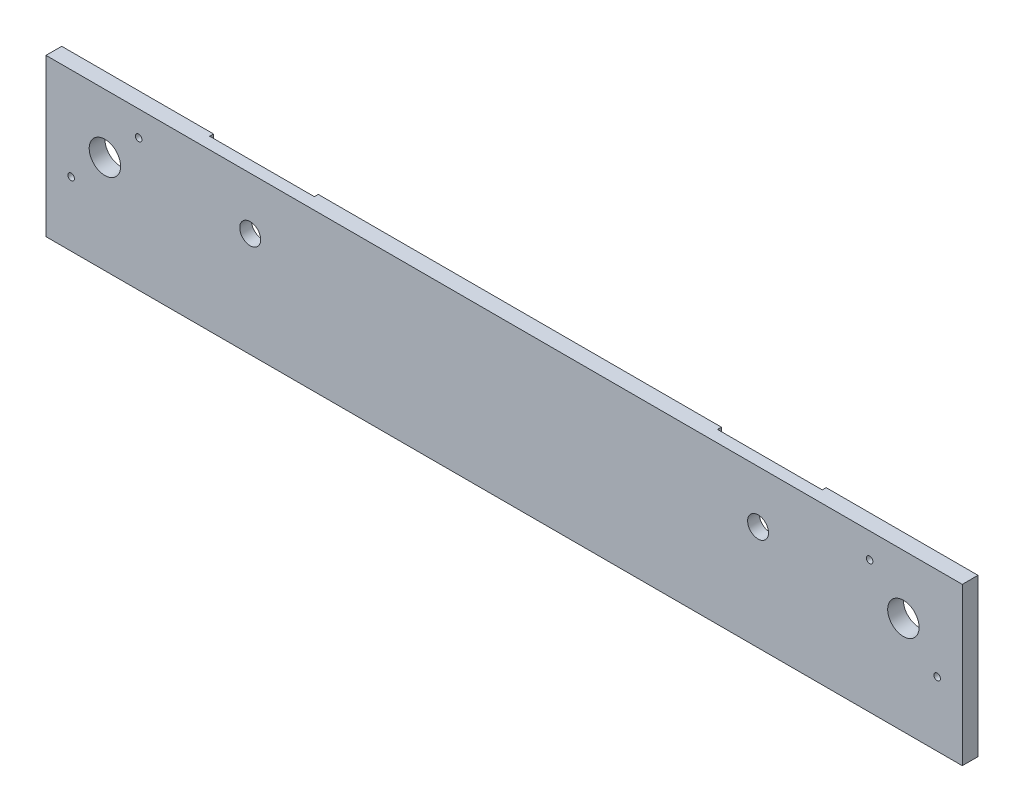
ISO-10303-21;
HEADER;
FILE_DESCRIPTION(('STEP AP214'),'2;1');
FILE_NAME('part.step','',(''),(''),'','','');
FILE_SCHEMA(('AUTOMOTIVE_DESIGN { 1 0 10303 214 1 1 1 1 }'));
ENDSEC;
DATA;
#1=APPLICATION_CONTEXT('core data for automotive mechanical design processes');
#2=APPLICATION_PROTOCOL_DEFINITION('international standard','automotive_design',2000,#1);
#3=PRODUCT_CONTEXT('',#1,'mechanical');
#4=PRODUCT('Part','Part','',(#3));
#5=PRODUCT_RELATED_PRODUCT_CATEGORY('part','',(#4));
#6=PRODUCT_DEFINITION_FORMATION('','',#4);
#7=PRODUCT_DEFINITION_CONTEXT('part definition',#1,'design');
#8=PRODUCT_DEFINITION('design','',#6,#7);
#9=PRODUCT_DEFINITION_SHAPE('','',#8);
#10=(LENGTH_UNIT() NAMED_UNIT(*) SI_UNIT(.MILLI.,.METRE.));
#11=(NAMED_UNIT(*) PLANE_ANGLE_UNIT() SI_UNIT($,.RADIAN.));
#12=(NAMED_UNIT(*) SI_UNIT($,.STERADIAN.) SOLID_ANGLE_UNIT());
#13=UNCERTAINTY_MEASURE_WITH_UNIT(LENGTH_MEASURE(1.E-05),#10,'distance_accuracy_value','');
#14=(GEOMETRIC_REPRESENTATION_CONTEXT(3) GLOBAL_UNCERTAINTY_ASSIGNED_CONTEXT((#13)) GLOBAL_UNIT_ASSIGNED_CONTEXT((#10,
#11,#12)) REPRESENTATION_CONTEXT('',''));
#15=CARTESIAN_POINT('',(0.,0.,0.));
#16=DIRECTION('',(0.,0.,1.));
#17=DIRECTION('',(1.,0.,0.));
#18=AXIS2_PLACEMENT_3D('',#15,#16,#17);
#19=CARTESIAN_POINT('',(-350.,0.,6.));
#20=DIRECTION('',(0.,1.,0.));
#21=DIRECTION('',(0.,0.,1.));
#22=AXIS2_PLACEMENT_3D('',#19,#20,#21);
#23=PLANE('',#22);
#24=DIRECTION('',(1.,0.,0.));
#25=VECTOR('',#24,1.);
#26=CARTESIAN_POINT('',(-350.,0.,0.));
#27=LINE('',#26,#25);
#28=CARTESIAN_POINT('',(-58.,0.,0.));
#29=VERTEX_POINT('',#28);
#30=CARTESIAN_POINT('',(0.,0.,0.));
#31=VERTEX_POINT('',#30);
#32=EDGE_CURVE('E294',#29,#31,#27,.T.);
#33=ORIENTED_EDGE('',*,*,#32,.F.);
#34=DIRECTION('',(0.,0.,-1.));
#35=VECTOR('',#34,1.);
#36=CARTESIAN_POINT('',(-58.,0.,1.5));
#37=LINE('',#36,#35);
#38=CARTESIAN_POINT('',(-58.,0.,1.5));
#39=VERTEX_POINT('',#38);
#40=EDGE_CURVE('E196',#39,#29,#37,.T.);
#41=ORIENTED_EDGE('',*,*,#40,.F.);
#42=DIRECTION('',(-1.,0.,0.));
#43=VECTOR('',#42,1.);
#44=CARTESIAN_POINT('',(0.,0.,1.5));
#45=LINE('',#44,#43);
#46=CARTESIAN_POINT('',(-98.,0.,1.5));
#47=VERTEX_POINT('',#46);
#48=EDGE_CURVE('E180',#39,#47,#45,.T.);
#49=ORIENTED_EDGE('',*,*,#48,.T.);
#50=DIRECTION('',(0.,0.,-1.));
#51=VECTOR('',#50,1.);
#52=CARTESIAN_POINT('',(-98.,0.,1.5));
#53=LINE('',#52,#51);
#54=CARTESIAN_POINT('',(-98.,0.,0.));
#55=VERTEX_POINT('',#54);
#56=EDGE_CURVE('E198',#47,#55,#53,.T.);
#57=ORIENTED_EDGE('',*,*,#56,.T.);
#58=CARTESIAN_POINT('',(-252.,0.,0.));
#59=VERTEX_POINT('',#58);
#60=EDGE_CURVE('E299',#59,#55,#27,.T.);
#61=ORIENTED_EDGE('',*,*,#60,.F.);
#62=DIRECTION('',(0.,0.,-1.));
#63=VECTOR('',#62,1.);
#64=CARTESIAN_POINT('',(-252.,0.,1.5));
#65=LINE('',#64,#63);
#66=CARTESIAN_POINT('',(-252.,0.,1.5));
#67=VERTEX_POINT('',#66);
#68=EDGE_CURVE('E234',#67,#59,#65,.T.);
#69=ORIENTED_EDGE('',*,*,#68,.F.);
#70=DIRECTION('',(-1.,0.,0.));
#71=VECTOR('',#70,1.);
#72=CARTESIAN_POINT('',(0.,0.,1.5));
#73=LINE('',#72,#71);
#74=CARTESIAN_POINT('',(-292.,0.,1.5));
#75=VERTEX_POINT('',#74);
#76=EDGE_CURVE('E215',#67,#75,#73,.T.);
#77=ORIENTED_EDGE('',*,*,#76,.T.);
#78=DIRECTION('',(0.,0.,-1.));
#79=VECTOR('',#78,1.);
#80=CARTESIAN_POINT('',(-292.,0.,1.5));
#81=LINE('',#80,#79);
#82=CARTESIAN_POINT('',(-292.,0.,0.));
#83=VERTEX_POINT('',#82);
#84=EDGE_CURVE('E236',#75,#83,#81,.T.);
#85=ORIENTED_EDGE('',*,*,#84,.T.);
#86=CARTESIAN_POINT('',(-350.,0.,0.));
#87=VERTEX_POINT('',#86);
#88=EDGE_CURVE('E295',#87,#83,#27,.T.);
#89=ORIENTED_EDGE('',*,*,#88,.F.);
#90=DIRECTION('',(0.,0.,-1.));
#91=VECTOR('',#90,1.);
#92=CARTESIAN_POINT('',(-350.,0.,6.));
#93=LINE('',#92,#91);
#94=CARTESIAN_POINT('',(-350.,0.,6.));
#95=VERTEX_POINT('',#94);
#96=EDGE_CURVE('E291',#95,#87,#93,.T.);
#97=ORIENTED_EDGE('',*,*,#96,.F.);
#98=DIRECTION('',(1.,0.,0.));
#99=VECTOR('',#98,1.);
#100=CARTESIAN_POINT('',(-350.,0.,6.));
#101=LINE('',#100,#99);
#102=CARTESIAN_POINT('',(0.,0.,6.));
#103=VERTEX_POINT('',#102);
#104=EDGE_CURVE('E283',#95,#103,#101,.T.);
#105=ORIENTED_EDGE('',*,*,#104,.T.);
#106=DIRECTION('',(0.,0.,-1.));
#107=VECTOR('',#106,1.);
#108=CARTESIAN_POINT('',(0.,0.,6.));
#109=LINE('',#108,#107);
#110=EDGE_CURVE('E305',#103,#31,#109,.T.);
#111=ORIENTED_EDGE('',*,*,#110,.T.);
#112=EDGE_LOOP('',(#33,#41,#49,#57,#61,#69,#77,#85,#89,#97,#105,#111));
#113=FACE_BOUND('',#112,.T.);
#114=ADVANCED_FACE('F33',(#113),#23,.T.);
#115=CARTESIAN_POINT('',(0.,0.,0.));
#116=DIRECTION('',(0.,0.,-1.));
#117=DIRECTION('',(-1.,0.,0.));
#118=AXIS2_PLACEMENT_3D('',#115,#116,#117);
#119=PLANE('',#118);
#120=CARTESIAN_POINT('',(-9.59530124334555,-35.4046987566545,0.));
#121=DIRECTION('',(0.,0.,1.));
#122=DIRECTION('',(1.,0.,0.));
#123=AXIS2_PLACEMENT_3D('',#120,#121,#122);
#124=CIRCLE('',#123,1.25);
#125=CARTESIAN_POINT('',(-8.34530124334555,-35.4046987566545,0.));
#126=VERTEX_POINT('',#125);
#127=EDGE_CURVE('E269',#126,#126,#124,.T.);
#128=ORIENTED_EDGE('',*,*,#127,.T.);
#129=EDGE_LOOP('',(#128));
#130=FACE_BOUND('',#129,.T.);
#131=CARTESIAN_POINT('',(-35.4046987566545,-9.59530124334549,0.));
#132=DIRECTION('',(0.,0.,1.));
#133=DIRECTION('',(1.,0.,0.));
#134=AXIS2_PLACEMENT_3D('',#131,#132,#133);
#135=CIRCLE('',#134,1.25000000000001);
#136=CARTESIAN_POINT('',(-34.1546987566545,-9.59530124334549,0.));
#137=VERTEX_POINT('',#136);
#138=EDGE_CURVE('E263',#137,#137,#135,.T.);
#139=ORIENTED_EDGE('',*,*,#138,.T.);
#140=EDGE_LOOP('',(#139));
#141=FACE_BOUND('',#140,.T.);
#142=CARTESIAN_POINT('',(-314.595301243345,-9.59530124334546,0.));
#143=DIRECTION('',(0.,0.,1.));
#144=DIRECTION('',(1.,0.,0.));
#145=AXIS2_PLACEMENT_3D('',#142,#143,#144);
#146=CIRCLE('',#145,1.24999999999996);
#147=CARTESIAN_POINT('',(-313.345301243346,-9.59530124334546,0.));
#148=VERTEX_POINT('',#147);
#149=EDGE_CURVE('E257',#148,#148,#146,.T.);
#150=ORIENTED_EDGE('',*,*,#149,.T.);
#151=EDGE_LOOP('',(#150));
#152=FACE_BOUND('',#151,.T.);
#153=CARTESIAN_POINT('',(-340.404698756654,-35.4046987566545,0.));
#154=DIRECTION('',(0.,0.,1.));
#155=DIRECTION('',(1.,0.,0.));
#156=AXIS2_PLACEMENT_3D('',#153,#154,#155);
#157=CIRCLE('',#156,1.24999999999996);
#158=CARTESIAN_POINT('',(-339.154698756654,-35.4046987566545,0.));
#159=VERTEX_POINT('',#158);
#160=EDGE_CURVE('E251',#159,#159,#157,.T.);
#161=ORIENTED_EDGE('',*,*,#160,.T.);
#162=EDGE_LOOP('',(#161));
#163=FACE_BOUND('',#162,.T.);
#164=CARTESIAN_POINT('',(-22.5,-22.5,0.));
#165=DIRECTION('',(0.,0.,1.));
#166=DIRECTION('',(1.,0.,0.));
#167=AXIS2_PLACEMENT_3D('',#164,#165,#166);
#168=CIRCLE('',#167,6.);
#169=CARTESIAN_POINT('',(-16.5,-22.5,0.));
#170=VERTEX_POINT('',#169);
#171=EDGE_CURVE('E244',#170,#170,#168,.T.);
#172=ORIENTED_EDGE('',*,*,#171,.T.);
#173=EDGE_LOOP('',(#172));
#174=FACE_BOUND('',#173,.T.);
#175=CARTESIAN_POINT('',(-327.5,-22.5,0.));
#176=DIRECTION('',(0.,0.,1.));
#177=DIRECTION('',(1.,0.,0.));
#178=AXIS2_PLACEMENT_3D('',#175,#176,#177);
#179=CIRCLE('',#178,5.99999999999999);
#180=CARTESIAN_POINT('',(-321.5,-22.5,0.));
#181=VERTEX_POINT('',#180);
#182=EDGE_CURVE('E274',#181,#181,#179,.T.);
#183=ORIENTED_EDGE('',*,*,#182,.T.);
#184=EDGE_LOOP('',(#183));
#185=FACE_BOUND('',#184,.T.);
#186=CARTESIAN_POINT('',(-62.,-36.,0.));
#187=DIRECTION('',(0.,0.,-1.));
#188=DIRECTION('',(-1.,0.,0.));
#189=AXIS2_PLACEMENT_3D('',#186,#187,#188);
#190=CIRCLE('',#189,4.);
#191=CARTESIAN_POINT('',(-58.,-36.,0.));
#192=VERTEX_POINT('',#191);
#193=CARTESIAN_POINT('',(-62.,-40.,0.));
#194=VERTEX_POINT('',#193);
#195=EDGE_CURVE('E50',#192,#194,#190,.T.);
#196=ORIENTED_EDGE('',*,*,#195,.F.);
#197=DIRECTION('',(0.,1.,0.));
#198=VECTOR('',#197,1.);
#199=CARTESIAN_POINT('',(-58.,0.,0.));
#200=LINE('',#199,#198);
#201=EDGE_CURVE('E168',#192,#29,#200,.T.);
#202=ORIENTED_EDGE('',*,*,#201,.T.);
#203=ORIENTED_EDGE('',*,*,#32,.T.);
#204=DIRECTION('',(0.,1.,0.));
#205=VECTOR('',#204,1.);
#206=CARTESIAN_POINT('',(0.,-60.,0.));
#207=LINE('',#206,#205);
#208=CARTESIAN_POINT('',(0.,-60.,0.));
#209=VERTEX_POINT('',#208);
#210=EDGE_CURVE('E298',#209,#31,#207,.T.);
#211=ORIENTED_EDGE('',*,*,#210,.F.);
#212=DIRECTION('',(1.,0.,0.));
#213=VECTOR('',#212,1.);
#214=CARTESIAN_POINT('',(-350.,-60.,0.));
#215=LINE('',#214,#213);
#216=CARTESIAN_POINT('',(-350.,-60.,0.));
#217=VERTEX_POINT('',#216);
#218=EDGE_CURVE('E284',#217,#209,#215,.T.);
#219=ORIENTED_EDGE('',*,*,#218,.F.);
#220=DIRECTION('',(0.,1.,0.));
#221=VECTOR('',#220,1.);
#222=CARTESIAN_POINT('',(-350.,-60.,0.));
#223=LINE('',#222,#221);
#224=EDGE_CURVE('E277',#217,#87,#223,.T.);
#225=ORIENTED_EDGE('',*,*,#224,.T.);
#226=ORIENTED_EDGE('',*,*,#88,.T.);
#227=DIRECTION('',(0.,-1.,0.));
#228=VECTOR('',#227,1.);
#229=CARTESIAN_POINT('',(-292.,0.,0.));
#230=LINE('',#229,#228);
#231=CARTESIAN_POINT('',(-292.,-36.,0.));
#232=VERTEX_POINT('',#231);
#233=EDGE_CURVE('E228',#83,#232,#230,.T.);
#234=ORIENTED_EDGE('',*,*,#233,.T.);
#235=CARTESIAN_POINT('',(-288.,-36.,0.));
#236=DIRECTION('',(0.,0.,-1.));
#237=DIRECTION('',(-1.,0.,0.));
#238=AXIS2_PLACEMENT_3D('',#235,#236,#237);
#239=CIRCLE('',#238,4.);
#240=CARTESIAN_POINT('',(-288.,-40.,0.));
#241=VERTEX_POINT('',#240);
#242=EDGE_CURVE('E225',#241,#232,#239,.T.);
#243=ORIENTED_EDGE('',*,*,#242,.F.);
#244=DIRECTION('',(1.,0.,0.));
#245=VECTOR('',#244,1.);
#246=CARTESIAN_POINT('',(0.,-40.,0.));
#247=LINE('',#246,#245);
#248=CARTESIAN_POINT('',(-256.,-40.,0.));
#249=VERTEX_POINT('',#248);
#250=EDGE_CURVE('E222',#241,#249,#247,.T.);
#251=ORIENTED_EDGE('',*,*,#250,.T.);
#252=CARTESIAN_POINT('',(-256.,-36.,0.));
#253=DIRECTION('',(0.,0.,-1.));
#254=DIRECTION('',(-1.,0.,0.));
#255=AXIS2_PLACEMENT_3D('',#252,#253,#254);
#256=CIRCLE('',#255,4.);
#257=CARTESIAN_POINT('',(-252.,-36.,0.));
#258=VERTEX_POINT('',#257);
#259=EDGE_CURVE('E58',#258,#249,#256,.T.);
#260=ORIENTED_EDGE('',*,*,#259,.F.);
#261=DIRECTION('',(0.,1.,0.));
#262=VECTOR('',#261,1.);
#263=CARTESIAN_POINT('',(-252.,0.,0.));
#264=LINE('',#263,#262);
#265=EDGE_CURVE('E208',#258,#59,#264,.T.);
#266=ORIENTED_EDGE('',*,*,#265,.T.);
#267=ORIENTED_EDGE('',*,*,#60,.T.);
#268=DIRECTION('',(0.,-1.,0.));
#269=VECTOR('',#268,1.);
#270=CARTESIAN_POINT('',(-98.,0.,0.));
#271=LINE('',#270,#269);
#272=CARTESIAN_POINT('',(-98.,-36.,0.));
#273=VERTEX_POINT('',#272);
#274=EDGE_CURVE('E171',#55,#273,#271,.T.);
#275=ORIENTED_EDGE('',*,*,#274,.T.);
#276=CARTESIAN_POINT('',(-94.,-36.,0.));
#277=DIRECTION('',(0.,0.,-1.));
#278=DIRECTION('',(-1.,0.,0.));
#279=AXIS2_PLACEMENT_3D('',#276,#277,#278);
#280=CIRCLE('',#279,4.);
#281=CARTESIAN_POINT('',(-94.,-40.,0.));
#282=VERTEX_POINT('',#281);
#283=EDGE_CURVE('E188',#282,#273,#280,.T.);
#284=ORIENTED_EDGE('',*,*,#283,.F.);
#285=DIRECTION('',(1.,0.,0.));
#286=VECTOR('',#285,1.);
#287=CARTESIAN_POINT('',(0.,-40.,0.));
#288=LINE('',#287,#286);
#289=EDGE_CURVE('E185',#282,#194,#288,.T.);
#290=ORIENTED_EDGE('',*,*,#289,.T.);
#291=EDGE_LOOP('',(#196,#202,#203,#211,#219,#225,#226,#234,#243,#251,#260,#266,#267,#275,#284,#290));
#292=FACE_BOUND('',#291,.T.);
#293=ADVANCED_FACE('F358',(#130,#141,#152,#163,#174,#185,#292),#119,.T.);
#294=CARTESIAN_POINT('',(-350.,-60.,6.));
#295=DIRECTION('',(-1.,0.,0.));
#296=DIRECTION('',(0.,0.,1.));
#297=AXIS2_PLACEMENT_3D('',#294,#295,#296);
#298=PLANE('',#297);
#299=ORIENTED_EDGE('',*,*,#224,.F.);
#300=DIRECTION('',(0.,0.,-1.));
#301=VECTOR('',#300,1.);
#302=CARTESIAN_POINT('',(-350.,-60.,6.));
#303=LINE('',#302,#301);
#304=CARTESIAN_POINT('',(-350.,-60.,6.));
#305=VERTEX_POINT('',#304);
#306=EDGE_CURVE('E11',#305,#217,#303,.T.);
#307=ORIENTED_EDGE('',*,*,#306,.F.);
#308=DIRECTION('',(0.,1.,0.));
#309=VECTOR('',#308,1.);
#310=CARTESIAN_POINT('',(-350.,-60.,6.));
#311=LINE('',#310,#309);
#312=EDGE_CURVE('E280',#305,#95,#311,.T.);
#313=ORIENTED_EDGE('',*,*,#312,.T.);
#314=ORIENTED_EDGE('',*,*,#96,.T.);
#315=EDGE_LOOP('',(#299,#307,#313,#314));
#316=FACE_BOUND('',#315,.T.);
#317=ADVANCED_FACE('F35',(#316),#298,.T.);
#318=CARTESIAN_POINT('',(-350.,-60.,6.));
#319=DIRECTION('',(0.,1.,0.));
#320=DIRECTION('',(0.,0.,1.));
#321=AXIS2_PLACEMENT_3D('',#318,#319,#320);
#322=PLANE('',#321);
#323=ORIENTED_EDGE('',*,*,#218,.T.);
#324=DIRECTION('',(0.,0.,-1.));
#325=VECTOR('',#324,1.);
#326=CARTESIAN_POINT('',(0.,-60.,6.));
#327=LINE('',#326,#325);
#328=CARTESIAN_POINT('',(0.,-60.,6.));
#329=VERTEX_POINT('',#328);
#330=EDGE_CURVE('E42',#329,#209,#327,.T.);
#331=ORIENTED_EDGE('',*,*,#330,.F.);
#332=DIRECTION('',(1.,0.,0.));
#333=VECTOR('',#332,1.);
#334=CARTESIAN_POINT('',(-350.,-60.,6.));
#335=LINE('',#334,#333);
#336=EDGE_CURVE('E289',#305,#329,#335,.T.);
#337=ORIENTED_EDGE('',*,*,#336,.F.);
#338=ORIENTED_EDGE('',*,*,#306,.T.);
#339=EDGE_LOOP('',(#323,#331,#337,#338));
#340=FACE_BOUND('',#339,.T.);
#341=ADVANCED_FACE('F350',(#340),#322,.F.);
#342=CARTESIAN_POINT('',(0.,-60.,6.));
#343=DIRECTION('',(-1.,0.,0.));
#344=DIRECTION('',(0.,0.,1.));
#345=AXIS2_PLACEMENT_3D('',#342,#343,#344);
#346=PLANE('',#345);
#347=ORIENTED_EDGE('',*,*,#210,.T.);
#348=ORIENTED_EDGE('',*,*,#110,.F.);
#349=DIRECTION('',(0.,1.,0.));
#350=VECTOR('',#349,1.);
#351=CARTESIAN_POINT('',(0.,-60.,6.));
#352=LINE('',#351,#350);
#353=EDGE_CURVE('E287',#329,#103,#352,.T.);
#354=ORIENTED_EDGE('',*,*,#353,.F.);
#355=ORIENTED_EDGE('',*,*,#330,.T.);
#356=EDGE_LOOP('',(#347,#348,#354,#355));
#357=FACE_BOUND('',#356,.T.);
#358=ADVANCED_FACE('F326',(#357),#346,.F.);
#359=CARTESIAN_POINT('',(0.,0.,6.));
#360=DIRECTION('',(0.,0.,-1.));
#361=DIRECTION('',(-1.,0.,0.));
#362=AXIS2_PLACEMENT_3D('',#359,#360,#361);
#363=PLANE('',#362);
#364=CARTESIAN_POINT('',(-272.,-20.,6.));
#365=DIRECTION('',(0.,0.,1.));
#366=DIRECTION('',(1.,0.,0.));
#367=AXIS2_PLACEMENT_3D('',#364,#365,#366);
#368=CIRCLE('',#367,3.99999999999999);
#369=CARTESIAN_POINT('',(-268.,-20.,6.));
#370=VERTEX_POINT('',#369);
#371=EDGE_CURVE('E310',#370,#370,#368,.T.);
#372=ORIENTED_EDGE('',*,*,#371,.F.);
#373=EDGE_LOOP('',(#372));
#374=FACE_BOUND('',#373,.T.);
#375=CARTESIAN_POINT('',(-78.,-20.,6.));
#376=DIRECTION('',(0.,0.,1.));
#377=DIRECTION('',(1.,0.,0.));
#378=AXIS2_PLACEMENT_3D('',#375,#376,#377);
#379=CIRCLE('',#378,4.00000000000001);
#380=CARTESIAN_POINT('',(-74.,-20.,6.));
#381=VERTEX_POINT('',#380);
#382=EDGE_CURVE('E174',#381,#381,#379,.T.);
#383=ORIENTED_EDGE('',*,*,#382,.F.);
#384=EDGE_LOOP('',(#383));
#385=FACE_BOUND('',#384,.T.);
#386=CARTESIAN_POINT('',(-9.59530124334555,-35.4046987566545,6.));
#387=DIRECTION('',(0.,0.,1.));
#388=DIRECTION('',(1.,0.,0.));
#389=AXIS2_PLACEMENT_3D('',#386,#387,#388);
#390=CIRCLE('',#389,1.25);
#391=CARTESIAN_POINT('',(-8.34530124334555,-35.4046987566545,6.));
#392=VERTEX_POINT('',#391);
#393=EDGE_CURVE('E195',#392,#392,#390,.T.);
#394=ORIENTED_EDGE('',*,*,#393,.F.);
#395=EDGE_LOOP('',(#394));
#396=FACE_BOUND('',#395,.T.);
#397=CARTESIAN_POINT('',(-35.4046987566545,-9.59530124334549,6.));
#398=DIRECTION('',(0.,0.,1.));
#399=DIRECTION('',(1.,0.,0.));
#400=AXIS2_PLACEMENT_3D('',#397,#398,#399);
#401=CIRCLE('',#400,1.25000000000001);
#402=CARTESIAN_POINT('',(-34.1546987566545,-9.59530124334549,6.));
#403=VERTEX_POINT('',#402);
#404=EDGE_CURVE('E266',#403,#403,#401,.T.);
#405=ORIENTED_EDGE('',*,*,#404,.F.);
#406=EDGE_LOOP('',(#405));
#407=FACE_BOUND('',#406,.T.);
#408=CARTESIAN_POINT('',(-314.595301243345,-9.59530124334546,6.));
#409=DIRECTION('',(0.,0.,1.));
#410=DIRECTION('',(1.,0.,0.));
#411=AXIS2_PLACEMENT_3D('',#408,#409,#410);
#412=CIRCLE('',#411,1.24999999999996);
#413=CARTESIAN_POINT('',(-313.345301243346,-9.59530124334546,6.));
#414=VERTEX_POINT('',#413);
#415=EDGE_CURVE('E260',#414,#414,#412,.T.);
#416=ORIENTED_EDGE('',*,*,#415,.F.);
#417=EDGE_LOOP('',(#416));
#418=FACE_BOUND('',#417,.T.);
#419=CARTESIAN_POINT('',(-340.404698756654,-35.4046987566545,6.));
#420=DIRECTION('',(0.,0.,1.));
#421=DIRECTION('',(1.,0.,0.));
#422=AXIS2_PLACEMENT_3D('',#419,#420,#421);
#423=CIRCLE('',#422,1.24999999999996);
#424=CARTESIAN_POINT('',(-339.154698756654,-35.4046987566545,6.));
#425=VERTEX_POINT('',#424);
#426=EDGE_CURVE('E254',#425,#425,#423,.T.);
#427=ORIENTED_EDGE('',*,*,#426,.F.);
#428=EDGE_LOOP('',(#427));
#429=FACE_BOUND('',#428,.T.);
#430=CARTESIAN_POINT('',(-22.5,-22.5,6.));
#431=DIRECTION('',(0.,0.,1.));
#432=DIRECTION('',(1.,0.,0.));
#433=AXIS2_PLACEMENT_3D('',#430,#431,#432);
#434=CIRCLE('',#433,6.);
#435=CARTESIAN_POINT('',(-16.5,-22.5,6.));
#436=VERTEX_POINT('',#435);
#437=EDGE_CURVE('E248',#436,#436,#434,.T.);
#438=ORIENTED_EDGE('',*,*,#437,.F.);
#439=EDGE_LOOP('',(#438));
#440=FACE_BOUND('',#439,.T.);
#441=CARTESIAN_POINT('',(-327.5,-22.5,6.));
#442=DIRECTION('',(0.,0.,1.));
#443=DIRECTION('',(1.,0.,0.));
#444=AXIS2_PLACEMENT_3D('',#441,#442,#443);
#445=CIRCLE('',#444,5.99999999999999);
#446=CARTESIAN_POINT('',(-321.5,-22.5,6.));
#447=VERTEX_POINT('',#446);
#448=EDGE_CURVE('E247',#447,#447,#445,.T.);
#449=ORIENTED_EDGE('',*,*,#448,.F.);
#450=EDGE_LOOP('',(#449));
#451=FACE_BOUND('',#450,.T.);
#452=ORIENTED_EDGE('',*,*,#312,.F.);
#453=ORIENTED_EDGE('',*,*,#336,.T.);
#454=ORIENTED_EDGE('',*,*,#353,.T.);
#455=ORIENTED_EDGE('',*,*,#104,.F.);
#456=EDGE_LOOP('',(#452,#453,#454,#455));
#457=FACE_BOUND('',#456,.T.);
#458=ADVANCED_FACE('F322',(#374,#385,#396,#407,#418,#429,#440,#451,#457),#363,.F.);
#459=CARTESIAN_POINT('',(-327.5,-22.5,0.));
#460=DIRECTION('',(0.,0.,1.));
#461=DIRECTION('',(1.,0.,0.));
#462=AXIS2_PLACEMENT_3D('',#459,#460,#461);
#463=CYLINDRICAL_SURFACE('',#462,5.99999999999999);
#464=ORIENTED_EDGE('',*,*,#182,.F.);
#465=EDGE_LOOP('',(#464));
#466=FACE_BOUND('',#465,.T.);
#467=ORIENTED_EDGE('',*,*,#448,.T.);
#468=EDGE_LOOP('',(#467));
#469=FACE_BOUND('',#468,.T.);
#470=ADVANCED_FACE('F325',(#466,#469),#463,.F.);
#471=CARTESIAN_POINT('',(-22.5,-22.5,0.));
#472=DIRECTION('',(0.,0.,1.));
#473=DIRECTION('',(1.,0.,0.));
#474=AXIS2_PLACEMENT_3D('',#471,#472,#473);
#475=CYLINDRICAL_SURFACE('',#474,6.);
#476=ORIENTED_EDGE('',*,*,#171,.F.);
#477=EDGE_LOOP('',(#476));
#478=FACE_BOUND('',#477,.T.);
#479=ORIENTED_EDGE('',*,*,#437,.T.);
#480=EDGE_LOOP('',(#479));
#481=FACE_BOUND('',#480,.T.);
#482=ADVANCED_FACE('F394',(#478,#481),#475,.F.);
#483=CARTESIAN_POINT('',(-340.404698756654,-35.4046987566545,0.));
#484=DIRECTION('',(0.,0.,1.));
#485=DIRECTION('',(1.,0.,0.));
#486=AXIS2_PLACEMENT_3D('',#483,#484,#485);
#487=CYLINDRICAL_SURFACE('',#486,1.24999999999996);
#488=ORIENTED_EDGE('',*,*,#160,.F.);
#489=EDGE_LOOP('',(#488));
#490=FACE_BOUND('',#489,.T.);
#491=ORIENTED_EDGE('',*,*,#426,.T.);
#492=EDGE_LOOP('',(#491));
#493=FACE_BOUND('',#492,.T.);
#494=ADVANCED_FACE('F408',(#490,#493),#487,.F.);
#495=CARTESIAN_POINT('',(-314.595301243345,-9.59530124334546,0.));
#496=DIRECTION('',(0.,0.,1.));
#497=DIRECTION('',(1.,0.,0.));
#498=AXIS2_PLACEMENT_3D('',#495,#496,#497);
#499=CYLINDRICAL_SURFACE('',#498,1.24999999999996);
#500=ORIENTED_EDGE('',*,*,#149,.F.);
#501=EDGE_LOOP('',(#500));
#502=FACE_BOUND('',#501,.T.);
#503=ORIENTED_EDGE('',*,*,#415,.T.);
#504=EDGE_LOOP('',(#503));
#505=FACE_BOUND('',#504,.T.);
#506=ADVANCED_FACE('F404',(#502,#505),#499,.F.);
#507=CARTESIAN_POINT('',(-35.4046987566545,-9.59530124334549,0.));
#508=DIRECTION('',(0.,0.,1.));
#509=DIRECTION('',(1.,0.,0.));
#510=AXIS2_PLACEMENT_3D('',#507,#508,#509);
#511=CYLINDRICAL_SURFACE('',#510,1.25000000000001);
#512=ORIENTED_EDGE('',*,*,#138,.F.);
#513=EDGE_LOOP('',(#512));
#514=FACE_BOUND('',#513,.T.);
#515=ORIENTED_EDGE('',*,*,#404,.T.);
#516=EDGE_LOOP('',(#515));
#517=FACE_BOUND('',#516,.T.);
#518=ADVANCED_FACE('F400',(#514,#517),#511,.F.);
#519=CARTESIAN_POINT('',(-9.59530124334555,-35.4046987566545,0.));
#520=DIRECTION('',(0.,0.,1.));
#521=DIRECTION('',(1.,0.,0.));
#522=AXIS2_PLACEMENT_3D('',#519,#520,#521);
#523=CYLINDRICAL_SURFACE('',#522,1.25);
#524=ORIENTED_EDGE('',*,*,#127,.F.);
#525=EDGE_LOOP('',(#524));
#526=FACE_BOUND('',#525,.T.);
#527=ORIENTED_EDGE('',*,*,#393,.T.);
#528=EDGE_LOOP('',(#527));
#529=FACE_BOUND('',#528,.T.);
#530=ADVANCED_FACE('F396',(#526,#529),#523,.F.);
#531=CARTESIAN_POINT('',(-256.,-36.,1.5));
#532=DIRECTION('',(0.,0.,-1.));
#533=DIRECTION('',(-1.,0.,0.));
#534=AXIS2_PLACEMENT_3D('',#531,#532,#533);
#535=CYLINDRICAL_SURFACE('',#534,4.);
#536=ORIENTED_EDGE('',*,*,#259,.T.);
#537=DIRECTION('',(0.,0.,-1.));
#538=VECTOR('',#537,1.);
#539=CARTESIAN_POINT('',(-256.,-40.,1.5));
#540=LINE('',#539,#538);
#541=CARTESIAN_POINT('',(-256.,-40.,1.5));
#542=VERTEX_POINT('',#541);
#543=EDGE_CURVE('E220',#542,#249,#540,.T.);
#544=ORIENTED_EDGE('',*,*,#543,.F.);
#545=CARTESIAN_POINT('',(-256.,-36.,1.5));
#546=DIRECTION('',(0.,0.,-1.));
#547=DIRECTION('',(-1.,0.,0.));
#548=AXIS2_PLACEMENT_3D('',#545,#546,#547);
#549=CIRCLE('',#548,4.);
#550=CARTESIAN_POINT('',(-252.,-36.,1.5));
#551=VERTEX_POINT('',#550);
#552=EDGE_CURVE('E204',#551,#542,#549,.T.);
#553=ORIENTED_EDGE('',*,*,#552,.F.);
#554=DIRECTION('',(0.,0.,-1.));
#555=VECTOR('',#554,1.);
#556=CARTESIAN_POINT('',(-252.,-36.,1.5));
#557=LINE('',#556,#555);
#558=EDGE_CURVE('E186',#551,#258,#557,.T.);
#559=ORIENTED_EDGE('',*,*,#558,.T.);
#560=EDGE_LOOP('',(#536,#544,#553,#559));
#561=FACE_BOUND('',#560,.T.);
#562=ADVANCED_FACE('F399',(#561),#535,.F.);
#563=CARTESIAN_POINT('',(-252.,0.,1.5));
#564=DIRECTION('',(-1.,0.,0.));
#565=DIRECTION('',(0.,0.,1.));
#566=AXIS2_PLACEMENT_3D('',#563,#564,#565);
#567=PLANE('',#566);
#568=ORIENTED_EDGE('',*,*,#265,.F.);
#569=ORIENTED_EDGE('',*,*,#558,.F.);
#570=DIRECTION('',(0.,1.,0.));
#571=VECTOR('',#570,1.);
#572=CARTESIAN_POINT('',(-252.,0.,1.5));
#573=LINE('',#572,#571);
#574=EDGE_CURVE('E218',#551,#67,#573,.T.);
#575=ORIENTED_EDGE('',*,*,#574,.T.);
#576=ORIENTED_EDGE('',*,*,#68,.T.);
#577=EDGE_LOOP('',(#568,#569,#575,#576));
#578=FACE_BOUND('',#577,.T.);
#579=ADVANCED_FACE('F418',(#578),#567,.T.);
#580=CARTESIAN_POINT('',(-292.,0.,1.5));
#581=DIRECTION('',(1.,0.,0.));
#582=DIRECTION('',(0.,0.,-1.));
#583=AXIS2_PLACEMENT_3D('',#580,#581,#582);
#584=PLANE('',#583);
#585=ORIENTED_EDGE('',*,*,#233,.F.);
#586=ORIENTED_EDGE('',*,*,#84,.F.);
#587=DIRECTION('',(0.,-1.,0.));
#588=VECTOR('',#587,1.);
#589=CARTESIAN_POINT('',(-292.,0.,1.5));
#590=LINE('',#589,#588);
#591=CARTESIAN_POINT('',(-292.,-36.,1.5));
#592=VERTEX_POINT('',#591);
#593=EDGE_CURVE('E213',#75,#592,#590,.T.);
#594=ORIENTED_EDGE('',*,*,#593,.T.);
#595=DIRECTION('',(0.,0.,-1.));
#596=VECTOR('',#595,1.);
#597=CARTESIAN_POINT('',(-292.,-36.,1.5));
#598=LINE('',#597,#596);
#599=EDGE_CURVE('E239',#592,#232,#598,.T.);
#600=ORIENTED_EDGE('',*,*,#599,.T.);
#601=EDGE_LOOP('',(#585,#586,#594,#600));
#602=FACE_BOUND('',#601,.T.);
#603=ADVANCED_FACE('F427',(#602),#584,.T.);
#604=CARTESIAN_POINT('',(-288.,-36.,1.5));
#605=DIRECTION('',(0.,0.,-1.));
#606=DIRECTION('',(-1.,0.,0.));
#607=AXIS2_PLACEMENT_3D('',#604,#605,#606);
#608=CYLINDRICAL_SURFACE('',#607,4.);
#609=ORIENTED_EDGE('',*,*,#242,.T.);
#610=ORIENTED_EDGE('',*,*,#599,.F.);
#611=CARTESIAN_POINT('',(-288.,-36.,1.5));
#612=DIRECTION('',(0.,0.,-1.));
#613=DIRECTION('',(-1.,0.,0.));
#614=AXIS2_PLACEMENT_3D('',#611,#612,#613);
#615=CIRCLE('',#614,4.);
#616=CARTESIAN_POINT('',(-288.,-40.,1.5));
#617=VERTEX_POINT('',#616);
#618=EDGE_CURVE('E210',#617,#592,#615,.T.);
#619=ORIENTED_EDGE('',*,*,#618,.F.);
#620=DIRECTION('',(0.,0.,-1.));
#621=VECTOR('',#620,1.);
#622=CARTESIAN_POINT('',(-288.,-40.,1.5));
#623=LINE('',#622,#621);
#624=EDGE_CURVE('E241',#617,#241,#623,.T.);
#625=ORIENTED_EDGE('',*,*,#624,.T.);
#626=EDGE_LOOP('',(#609,#610,#619,#625));
#627=FACE_BOUND('',#626,.T.);
#628=ADVANCED_FACE('F423',(#627),#608,.F.);
#629=CARTESIAN_POINT('',(0.,-40.,1.5));
#630=DIRECTION('',(0.,1.,0.));
#631=DIRECTION('',(0.,0.,1.));
#632=AXIS2_PLACEMENT_3D('',#629,#630,#631);
#633=PLANE('',#632);
#634=ORIENTED_EDGE('',*,*,#250,.F.);
#635=ORIENTED_EDGE('',*,*,#624,.F.);
#636=DIRECTION('',(1.,0.,0.));
#637=VECTOR('',#636,1.);
#638=CARTESIAN_POINT('',(0.,-40.,1.5));
#639=LINE('',#638,#637);
#640=EDGE_CURVE('E207',#617,#542,#639,.T.);
#641=ORIENTED_EDGE('',*,*,#640,.T.);
#642=ORIENTED_EDGE('',*,*,#543,.T.);
#643=EDGE_LOOP('',(#634,#635,#641,#642));
#644=FACE_BOUND('',#643,.T.);
#645=ADVANCED_FACE('F419',(#644),#633,.T.);
#646=CARTESIAN_POINT('',(-256.,-36.,1.5));
#647=DIRECTION('',(0.,0.,-1.));
#648=DIRECTION('',(-1.,0.,0.));
#649=AXIS2_PLACEMENT_3D('',#646,#647,#648);
#650=PLANE('',#649);
#651=CARTESIAN_POINT('',(-272.,-20.,1.5));
#652=DIRECTION('',(0.,0.,-1.));
#653=DIRECTION('',(-1.,0.,0.));
#654=AXIS2_PLACEMENT_3D('',#651,#652,#653);
#655=CIRCLE('',#654,3.99999999999999);
#656=CARTESIAN_POINT('',(-276.,-20.,1.5));
#657=VERTEX_POINT('',#656);
#658=EDGE_CURVE('E37',#657,#657,#655,.T.);
#659=ORIENTED_EDGE('',*,*,#658,.F.);
#660=EDGE_LOOP('',(#659));
#661=FACE_BOUND('',#660,.T.);
#662=ORIENTED_EDGE('',*,*,#552,.T.);
#663=ORIENTED_EDGE('',*,*,#640,.F.);
#664=ORIENTED_EDGE('',*,*,#618,.T.);
#665=ORIENTED_EDGE('',*,*,#593,.F.);
#666=ORIENTED_EDGE('',*,*,#76,.F.);
#667=ORIENTED_EDGE('',*,*,#574,.F.);
#668=EDGE_LOOP('',(#662,#663,#664,#665,#666,#667));
#669=FACE_BOUND('',#668,.T.);
#670=ADVANCED_FACE('F422',(#661,#669),#650,.T.);
#671=CARTESIAN_POINT('',(-62.,-36.,1.5));
#672=DIRECTION('',(0.,0.,-1.));
#673=DIRECTION('',(-1.,0.,0.));
#674=AXIS2_PLACEMENT_3D('',#671,#672,#673);
#675=CYLINDRICAL_SURFACE('',#674,4.);
#676=ORIENTED_EDGE('',*,*,#195,.T.);
#677=DIRECTION('',(0.,0.,-1.));
#678=VECTOR('',#677,1.);
#679=CARTESIAN_POINT('',(-62.,-40.,1.5));
#680=LINE('',#679,#678);
#681=CARTESIAN_POINT('',(-62.,-40.,1.5));
#682=VERTEX_POINT('',#681);
#683=EDGE_CURVE('E151',#682,#194,#680,.T.);
#684=ORIENTED_EDGE('',*,*,#683,.F.);
#685=CARTESIAN_POINT('',(-62.,-36.,1.5));
#686=DIRECTION('',(0.,0.,-1.));
#687=DIRECTION('',(-1.,0.,0.));
#688=AXIS2_PLACEMENT_3D('',#685,#686,#687);
#689=CIRCLE('',#688,4.);
#690=CARTESIAN_POINT('',(-58.,-36.,1.5));
#691=VERTEX_POINT('',#690);
#692=EDGE_CURVE('E159',#691,#682,#689,.T.);
#693=ORIENTED_EDGE('',*,*,#692,.F.);
#694=DIRECTION('',(0.,0.,-1.));
#695=VECTOR('',#694,1.);
#696=CARTESIAN_POINT('',(-58.,-36.,1.5));
#697=LINE('',#696,#695);
#698=EDGE_CURVE('E193',#691,#192,#697,.T.);
#699=ORIENTED_EDGE('',*,*,#698,.T.);
#700=EDGE_LOOP('',(#676,#684,#693,#699));
#701=FACE_BOUND('',#700,.T.);
#702=ADVANCED_FACE('F162',(#701),#675,.F.);
#703=CARTESIAN_POINT('',(-58.,0.,1.5));
#704=DIRECTION('',(-1.,0.,0.));
#705=DIRECTION('',(0.,-1.,0.));
#706=AXIS2_PLACEMENT_3D('',#703,#704,#705);
#707=PLANE('',#706);
#708=ORIENTED_EDGE('',*,*,#201,.F.);
#709=ORIENTED_EDGE('',*,*,#698,.F.);
#710=DIRECTION('',(0.,1.,0.));
#711=VECTOR('',#710,1.);
#712=CARTESIAN_POINT('',(-58.,0.,1.5));
#713=LINE('',#712,#711);
#714=EDGE_CURVE('E163',#691,#39,#713,.T.);
#715=ORIENTED_EDGE('',*,*,#714,.T.);
#716=ORIENTED_EDGE('',*,*,#40,.T.);
#717=EDGE_LOOP('',(#708,#709,#715,#716));
#718=FACE_BOUND('',#717,.T.);
#719=ADVANCED_FACE('F379',(#718),#707,.T.);
#720=CARTESIAN_POINT('',(-98.,0.,1.5));
#721=DIRECTION('',(1.,0.,0.));
#722=DIRECTION('',(0.,0.,-1.));
#723=AXIS2_PLACEMENT_3D('',#720,#721,#722);
#724=PLANE('',#723);
#725=ORIENTED_EDGE('',*,*,#274,.F.);
#726=ORIENTED_EDGE('',*,*,#56,.F.);
#727=DIRECTION('',(0.,-1.,0.));
#728=VECTOR('',#727,1.);
#729=CARTESIAN_POINT('',(-98.,0.,1.5));
#730=LINE('',#729,#728);
#731=CARTESIAN_POINT('',(-98.,-36.,1.5));
#732=VERTEX_POINT('',#731);
#733=EDGE_CURVE('E178',#47,#732,#730,.T.);
#734=ORIENTED_EDGE('',*,*,#733,.T.);
#735=DIRECTION('',(0.,0.,-1.));
#736=VECTOR('',#735,1.);
#737=CARTESIAN_POINT('',(-98.,-36.,1.5));
#738=LINE('',#737,#736);
#739=EDGE_CURVE('E201',#732,#273,#738,.T.);
#740=ORIENTED_EDGE('',*,*,#739,.T.);
#741=EDGE_LOOP('',(#725,#726,#734,#740));
#742=FACE_BOUND('',#741,.T.);
#743=ADVANCED_FACE('F368',(#742),#724,.T.);
#744=CARTESIAN_POINT('',(-94.,-36.,1.5));
#745=DIRECTION('',(0.,0.,-1.));
#746=DIRECTION('',(-1.,0.,0.));
#747=AXIS2_PLACEMENT_3D('',#744,#745,#746);
#748=CYLINDRICAL_SURFACE('',#747,4.);
#749=ORIENTED_EDGE('',*,*,#283,.T.);
#750=ORIENTED_EDGE('',*,*,#739,.F.);
#751=CARTESIAN_POINT('',(-94.,-36.,1.5));
#752=DIRECTION('',(0.,0.,-1.));
#753=DIRECTION('',(-1.,0.,0.));
#754=AXIS2_PLACEMENT_3D('',#751,#752,#753);
#755=CIRCLE('',#754,4.);
#756=CARTESIAN_POINT('',(-94.,-40.,1.5));
#757=VERTEX_POINT('',#756);
#758=EDGE_CURVE('E158',#757,#732,#755,.T.);
#759=ORIENTED_EDGE('',*,*,#758,.F.);
#760=DIRECTION('',(0.,0.,-1.));
#761=VECTOR('',#760,1.);
#762=CARTESIAN_POINT('',(-94.,-40.,1.5));
#763=LINE('',#762,#761);
#764=EDGE_CURVE('E153',#757,#282,#763,.T.);
#765=ORIENTED_EDGE('',*,*,#764,.T.);
#766=EDGE_LOOP('',(#749,#750,#759,#765));
#767=FACE_BOUND('',#766,.T.);
#768=ADVANCED_FACE('F371',(#767),#748,.F.);
#769=CARTESIAN_POINT('',(0.,-40.,1.5));
#770=DIRECTION('',(0.,1.,0.));
#771=DIRECTION('',(0.,0.,1.));
#772=AXIS2_PLACEMENT_3D('',#769,#770,#771);
#773=PLANE('',#772);
#774=ORIENTED_EDGE('',*,*,#289,.F.);
#775=ORIENTED_EDGE('',*,*,#764,.F.);
#776=DIRECTION('',(1.,0.,0.));
#777=VECTOR('',#776,1.);
#778=CARTESIAN_POINT('',(0.,-40.,1.5));
#779=LINE('',#778,#777);
#780=EDGE_CURVE('E148',#757,#682,#779,.T.);
#781=ORIENTED_EDGE('',*,*,#780,.T.);
#782=ORIENTED_EDGE('',*,*,#683,.T.);
#783=EDGE_LOOP('',(#774,#775,#781,#782));
#784=FACE_BOUND('',#783,.T.);
#785=ADVANCED_FACE('F150',(#784),#773,.T.);
#786=CARTESIAN_POINT('',(-62.,-36.,1.5));
#787=DIRECTION('',(0.,0.,-1.));
#788=DIRECTION('',(-1.,0.,0.));
#789=AXIS2_PLACEMENT_3D('',#786,#787,#788);
#790=PLANE('',#789);
#791=CARTESIAN_POINT('',(-78.,-20.,1.5));
#792=DIRECTION('',(0.,0.,-1.));
#793=DIRECTION('',(-1.,0.,0.));
#794=AXIS2_PLACEMENT_3D('',#791,#792,#793);
#795=CIRCLE('',#794,4.00000000000001);
#796=CARTESIAN_POINT('',(-82.,-20.,1.5));
#797=VERTEX_POINT('',#796);
#798=EDGE_CURVE('E308',#797,#797,#795,.T.);
#799=ORIENTED_EDGE('',*,*,#798,.F.);
#800=EDGE_LOOP('',(#799));
#801=FACE_BOUND('',#800,.T.);
#802=ORIENTED_EDGE('',*,*,#692,.T.);
#803=ORIENTED_EDGE('',*,*,#780,.F.);
#804=ORIENTED_EDGE('',*,*,#758,.T.);
#805=ORIENTED_EDGE('',*,*,#733,.F.);
#806=ORIENTED_EDGE('',*,*,#48,.F.);
#807=ORIENTED_EDGE('',*,*,#714,.F.);
#808=EDGE_LOOP('',(#802,#803,#804,#805,#806,#807));
#809=FACE_BOUND('',#808,.T.);
#810=ADVANCED_FACE('F166',(#801,#809),#790,.T.);
#811=CARTESIAN_POINT('',(-78.,-20.,0.));
#812=DIRECTION('',(0.,0.,1.));
#813=DIRECTION('',(1.,0.,0.));
#814=AXIS2_PLACEMENT_3D('',#811,#812,#813);
#815=CYLINDRICAL_SURFACE('',#814,4.00000000000001);
#816=ORIENTED_EDGE('',*,*,#798,.T.);
#817=EDGE_LOOP('',(#816));
#818=FACE_BOUND('',#817,.T.);
#819=ORIENTED_EDGE('',*,*,#382,.T.);
#820=EDGE_LOOP('',(#819));
#821=FACE_BOUND('',#820,.T.);
#822=ADVANCED_FACE('F320',(#818,#821),#815,.F.);
#823=CARTESIAN_POINT('',(-272.,-20.,0.));
#824=DIRECTION('',(0.,0.,1.));
#825=DIRECTION('',(1.,0.,0.));
#826=AXIS2_PLACEMENT_3D('',#823,#824,#825);
#827=CYLINDRICAL_SURFACE('',#826,3.99999999999999);
#828=ORIENTED_EDGE('',*,*,#658,.T.);
#829=EDGE_LOOP('',(#828));
#830=FACE_BOUND('',#829,.T.);
#831=ORIENTED_EDGE('',*,*,#371,.T.);
#832=EDGE_LOOP('',(#831));
#833=FACE_BOUND('',#832,.T.);
#834=ADVANCED_FACE('F452',(#830,#833),#827,.F.);
#835=CLOSED_SHELL('',(#114,#293,#317,#341,#358,#458,#470,#482,#494,#506,#518,#530,#562,#579,
#603,#628,#645,#670,#702,#719,#743,#768,#785,#810,#822,#834));
#836=MANIFOLD_SOLID_BREP('B2',#835);
#837=ADVANCED_BREP_SHAPE_REPRESENTATION('',(#18,#836),#14);
#838=SHAPE_DEFINITION_REPRESENTATION(#9,#837);
ENDSEC;
END-ISO-10303-21;
